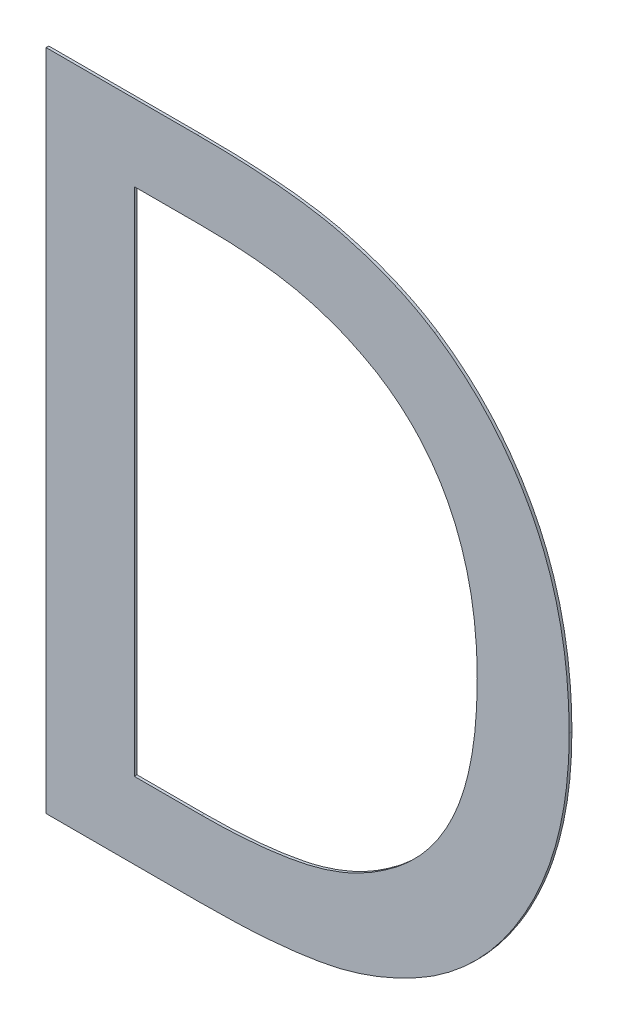
ISO-10303-21;
HEADER;
FILE_DESCRIPTION(('STEP AP214'),'2;1');
FILE_NAME('part.step','',(''),(''),'','','');
FILE_SCHEMA(('AUTOMOTIVE_DESIGN { 1 0 10303 214 1 1 1 1 }'));
ENDSEC;
DATA;
#1=APPLICATION_CONTEXT('core data for automotive mechanical design processes');
#2=APPLICATION_PROTOCOL_DEFINITION('international standard','automotive_design',2000,#1);
#3=PRODUCT_CONTEXT('',#1,'mechanical');
#4=PRODUCT('Part','Part','',(#3));
#5=PRODUCT_RELATED_PRODUCT_CATEGORY('part','',(#4));
#6=PRODUCT_DEFINITION_FORMATION('','',#4);
#7=PRODUCT_DEFINITION_CONTEXT('part definition',#1,'design');
#8=PRODUCT_DEFINITION('design','',#6,#7);
#9=PRODUCT_DEFINITION_SHAPE('','',#8);
#10=(LENGTH_UNIT() NAMED_UNIT(*) SI_UNIT(.MILLI.,.METRE.));
#11=(NAMED_UNIT(*) PLANE_ANGLE_UNIT() SI_UNIT($,.RADIAN.));
#12=(NAMED_UNIT(*) SI_UNIT($,.STERADIAN.) SOLID_ANGLE_UNIT());
#13=UNCERTAINTY_MEASURE_WITH_UNIT(LENGTH_MEASURE(1.E-05),#10,'distance_accuracy_value','');
#14=(GEOMETRIC_REPRESENTATION_CONTEXT(3) GLOBAL_UNCERTAINTY_ASSIGNED_CONTEXT((#13)) GLOBAL_UNIT_ASSIGNED_CONTEXT((#10,
#11,#12)) REPRESENTATION_CONTEXT('',''));
#15=CARTESIAN_POINT('',(0.,0.,0.));
#16=DIRECTION('',(0.,0.,1.));
#17=DIRECTION('',(1.,0.,0.));
#18=AXIS2_PLACEMENT_3D('',#15,#16,#17);
#19=CARTESIAN_POINT('',(-0.375230190296568,-1.23808482725956,0.));
#20=CARTESIAN_POINT('',(-0.375230190296568,-1.23808482725956,0.002));
#21=CARTESIAN_POINT('',(-0.34108108259972,-1.21505403369657,0.));
#22=CARTESIAN_POINT('',(-0.34108108259972,-1.21505403369657,0.002));
#23=CARTESIAN_POINT('',(-0.306931974902872,-1.13881416535012,0.));
#24=CARTESIAN_POINT('',(-0.306931974902872,-1.13881416535012,0.002));
#25=CARTESIAN_POINT('',(-0.306931974902872,-1.08163426409028,0.));
#26=CARTESIAN_POINT('',(-0.306931974902872,-1.08163426409028,0.002));
#27=B_SPLINE_SURFACE_WITH_KNOTS('',2,1,((#19,#20),(#21,#22),(#23,#24),(#25,#26)),.UNSPECIFIED.,
.F.,.F.,.F.,(3,1,3),(2,2),(0.,0.5,1.),(0.,1.),.UNSPECIFIED.);
#28=CARTESIAN_POINT('',(-0.375230190296568,-1.23808482725956,0.));
#29=CARTESIAN_POINT('',(-0.369071120010196,-1.2339546476136,0.));
#30=CARTESIAN_POINT('',(-0.363227315626951,-1.22934472335801,0.));
#31=CARTESIAN_POINT('',(-0.352341112252358,-1.21929144189648,0.));
#32=CARTESIAN_POINT('',(-0.347296320695378,-1.21385067251658,0.));
#33=CARTESIAN_POINT('',(-0.338234080051032,-1.20235511353973,0.));
#34=CARTESIAN_POINT('',(-0.334197566741436,-1.1963153243592,0.));
#35=CARTESIAN_POINT('',(-0.327044623987746,-1.18372060379909,0.));
#36=CARTESIAN_POINT('',(-0.323927870723671,-1.17716585475306,0.));
#37=CARTESIAN_POINT('',(-0.318400111465898,-1.16314582994729,0.));
#38=CARTESIAN_POINT('',(-0.316067864817408,-1.15564995582732,0.));
#39=CARTESIAN_POINT('',(-0.312285435497127,-1.14042791323623,0.));
#40=CARTESIAN_POINT('',(-0.310837633188868,-1.13270118148244,0.));
#41=CARTESIAN_POINT('',(-0.308738205524137,-1.11773485181182,0.));
#42=CARTESIAN_POINT('',(-0.308035135644672,-1.11050203727301,0.));
#43=CARTESIAN_POINT('',(-0.307135909254335,-1.09605493101003,0.));
#44=CARTESIAN_POINT('',(-0.306936213018837,-1.08884086834512,0.));
#45=CARTESIAN_POINT('',(-0.306931974902872,-1.08163426409028,0.));
#46=B_SPLINE_CURVE_WITH_KNOTS('',3,(#28,#29,#30,#31,#32,#33,#34,#35,#36,#37,#38,#39,#40,#41,#42,
#43,#44,#45),.UNSPECIFIED.,.F.,.F.,(4,2,2,2,2,2,2,2,4),(0.,0.0222348262861986,
0.0444017596600262,0.0661109238585652,0.0878124357665264,0.111292241318025,0.13483496437413,
0.156617057358406,0.178245545840537),.UNSPECIFIED.);
#47=CARTESIAN_POINT('',(-0.375230190296568,-1.23808482725956,0.));
#48=VERTEX_POINT('',#47);
#49=CARTESIAN_POINT('',(-0.306931974902872,-1.08163426409028,0.));
#50=VERTEX_POINT('',#49);
#51=EDGE_CURVE('E11',#48,#50,#46,.T.);
#52=DIRECTION('',(0.,0.,1.));
#53=VECTOR('',#52,1.);
#54=CARTESIAN_POINT('',(-0.375230190296568,-1.23808482725956,0.));
#55=LINE('',#54,#53);
#56=CARTESIAN_POINT('',(-0.375230190296568,-1.23808482725956,0.002));
#57=VERTEX_POINT('',#56);
#58=EDGE_CURVE('E254',#48,#57,#55,.T.);
#59=CARTESIAN_POINT('',(-0.306931974902872,-1.08163426409028,0.002));
#60=CARTESIAN_POINT('',(-0.306960944569356,-1.09311216923514,0.002));
#61=CARTESIAN_POINT('',(-0.307453841034369,-1.10466919796026,0.002));
#62=CARTESIAN_POINT('',(-0.309894937130853,-1.12777485772944,0.002));
#63=CARTESIAN_POINT('',(-0.311862661657671,-1.13932127621205,0.002));
#64=CARTESIAN_POINT('',(-0.31681199549396,-1.15812700217671,0.002));
#65=CARTESIAN_POINT('',(-0.31923288315732,-1.16552633653169,0.002));
#66=CARTESIAN_POINT('',(-0.325134557052641,-1.17985830346347,0.002));
#67=CARTESIAN_POINT('',(-0.328610378836024,-1.18679294017165,0.002));
#68=CARTESIAN_POINT('',(-0.33619291554513,-1.19934955880884,0.002));
#69=CARTESIAN_POINT('',(-0.340197643101653,-1.2050331633398,0.002));
#70=CARTESIAN_POINT('',(-0.349018886974442,-1.21574502638608,0.002));
#71=CARTESIAN_POINT('',(-0.353836050360118,-1.22077275682089,0.002));
#72=CARTESIAN_POINT('',(-0.36154597026652,-1.22772030855257,0.002));
#73=CARTESIAN_POINT('',(-0.364184675443781,-1.22992918087731,0.002));
#74=CARTESIAN_POINT('',(-0.369604145539521,-1.23415184819776,0.002));
#75=CARTESIAN_POINT('',(-0.372384568112839,-1.23616608216329,0.002));
#76=CARTESIAN_POINT('',(-0.375230190549302,-1.23808482743001,0.002));
#77=B_SPLINE_CURVE_WITH_KNOTS('',3,(#59,#60,#61,#62,#63,#64,#65,#66,#67,#68,#69,#70,#71,#72,#73,
#74,#75,#76),.UNSPECIFIED.,.F.,.F.,(4,2,2,2,2,2,2,2,4),(0.,0.034553978737306,0.0695736725759889,
0.0928581301950071,0.116034668435323,0.136821780288929,0.157625527030922,0.167941944336336,
0.178234523577318),.UNSPECIFIED.);
#78=CARTESIAN_POINT('',(-0.306931974902872,-1.08163426409028,0.002));
#79=VERTEX_POINT('',#78);
#80=EDGE_CURVE('E261',#79,#57,#77,.T.);
#81=DIRECTION('',(0.,0.,1.));
#82=VECTOR('',#81,1.);
#83=CARTESIAN_POINT('',(-0.306931974902872,-1.08163426409028,0.));
#84=LINE('',#83,#82);
#85=EDGE_CURVE('E280',#50,#79,#84,.T.);
#86=ORIENTED_EDGE('',*,*,#51,.F.);
#87=ORIENTED_EDGE('',*,*,#58,.T.);
#88=ORIENTED_EDGE('',*,*,#80,.F.);
#89=ORIENTED_EDGE('',*,*,#85,.F.);
#90=EDGE_LOOP('',(#86,#87,#88,#89));
#91=FACE_BOUND('',#90,.T.);
#92=ADVANCED_FACE('F17',(#91),#27,.F.);
#93=CARTESIAN_POINT('',(-0.510635373141046,-1.27064560436586,0.));
#94=CARTESIAN_POINT('',(-0.510635373141046,-1.27064560436586,0.002));
#95=CARTESIAN_POINT('',(-0.467353364548529,-1.27064560436586,0.));
#96=CARTESIAN_POINT('',(-0.467353364548529,-1.27064560436586,0.002));
#97=CARTESIAN_POINT('',(-0.401834727688298,-1.25674771169853,0.));
#98=CARTESIAN_POINT('',(-0.401834727688298,-1.25674771169853,0.002));
#99=CARTESIAN_POINT('',(-0.375230190296568,-1.23808482725956,0.));
#100=CARTESIAN_POINT('',(-0.375230190296568,-1.23808482725956,0.002));
#101=B_SPLINE_SURFACE_WITH_KNOTS('',2,1,((#93,#94),(#95,#96),(#97,#98),(#99,#100)),
.UNSPECIFIED.,.F.,.F.,.F.,(3,1,3),(2,2),(0.,0.5,1.),(0.,1.),.UNSPECIFIED.);
#102=CARTESIAN_POINT('',(-0.510635373141046,-1.27064560436586,0.));
#103=CARTESIAN_POINT('',(-0.504332889747488,-1.27064185696297,0.));
#104=CARTESIAN_POINT('',(-0.498027767844703,-1.27053399773559,0.));
#105=CARTESIAN_POINT('',(-0.485410139154331,-1.27005575539617,0.));
#106=CARTESIAN_POINT('',(-0.479097661306761,-1.26968463632515,0.));
#107=CARTESIAN_POINT('',(-0.466382061904667,-1.2686151741624,0.));
#108=CARTESIAN_POINT('',(-0.459979427612031,-1.26791089628076,0.));
#109=CARTESIAN_POINT('',(-0.447229597578087,-1.26613078942527,0.));
#110=CARTESIAN_POINT('',(-0.440882352227835,-1.26505533772997,0.));
#111=CARTESIAN_POINT('',(-0.430492329115305,-1.26281042261025,0.));
#112=CARTESIAN_POINT('',(-0.426415688707686,-1.2618036835315,0.));
#113=CARTESIAN_POINT('',(-0.418355337899598,-1.25947303527224,0.));
#114=CARTESIAN_POINT('',(-0.414371612361413,-1.25814917815841,0.));
#115=CARTESIAN_POINT('',(-0.402649026936383,-1.25373667010387,0.));
#116=CARTESIAN_POINT('',(-0.395072142135779,-1.25019324547952,0.));
#117=CARTESIAN_POINT('',(-0.385676402555752,-1.2448447458593,0.));
#118=CARTESIAN_POINT('',(-0.383546241988096,-1.24356351463242,0.));
#119=CARTESIAN_POINT('',(-0.379343286697743,-1.24089915146737,0.));
#120=CARTESIAN_POINT('',(-0.377270645313756,-1.23951577755444,0.));
#121=CARTESIAN_POINT('',(-0.375230190103475,-1.23808482712411,0.));
#122=B_SPLINE_CURVE_WITH_KNOTS('',3,(#102,#103,#104,#105,#106,#107,#108,#109,#110,#111,#112,
#113,#114,#115,#116,#117,#118,#119,#120,#121),.UNSPECIFIED.,.F.,.F.,(4,2,2,2,2,2,2,2,2,4),(0.,
0.0189108252165691,0.0378747262079458,0.0571899530628519,0.0764856045518722,0.0890717128648824,
0.101655756116182,0.126621762006657,0.134077444981571,0.141551395050654),.UNSPECIFIED.);
#123=CARTESIAN_POINT('',(-0.510635373141046,-1.27064560436586,0.));
#124=VERTEX_POINT('',#123);
#125=EDGE_CURVE('E32',#124,#48,#122,.T.);
#126=DIRECTION('',(0.,0.,1.));
#127=VECTOR('',#126,1.);
#128=CARTESIAN_POINT('',(-0.510635373141046,-1.27064560436586,0.));
#129=LINE('',#128,#127);
#130=CARTESIAN_POINT('',(-0.510635373141046,-1.27064560436586,0.002));
#131=VERTEX_POINT('',#130);
#132=EDGE_CURVE('E259',#124,#131,#129,.T.);
#133=CARTESIAN_POINT('',(-0.375230190296568,-1.23808482725956,0.002));
#134=CARTESIAN_POINT('',(-0.381865661201128,-1.24276171666051,0.002));
#135=CARTESIAN_POINT('',(-0.388874410773785,-1.24690509466637,0.002));
#136=CARTESIAN_POINT('',(-0.403335314191685,-1.25401944225042,0.002));
#137=CARTESIAN_POINT('',(-0.410779349169612,-1.25700689022562,0.002));
#138=CARTESIAN_POINT('',(-0.422773941941858,-1.26081595974773,0.002));
#139=CARTESIAN_POINT('',(-0.427207692247071,-1.26201823622905,0.002));
#140=CARTESIAN_POINT('',(-0.436154103349204,-1.2640872904202,0.002));
#141=CARTESIAN_POINT('',(-0.440666818706485,-1.26495382574649,0.002));
#142=CARTESIAN_POINT('',(-0.454308965494795,-1.26725223974172,0.002));
#143=CARTESIAN_POINT('',(-0.46349088749112,-1.26836932687121,0.002));
#144=CARTESIAN_POINT('',(-0.479034571388527,-1.26968120461285,0.002));
#145=CARTESIAN_POINT('',(-0.485383031765853,-1.27005496242888,0.002));
#146=CARTESIAN_POINT('',(-0.498033320415536,-1.27053397975994,0.002));
#147=CARTESIAN_POINT('',(-0.504335055055847,-1.27064162198114,0.002));
#148=CARTESIAN_POINT('',(-0.510635373141048,-1.27064560436586,0.002));
#149=B_SPLINE_CURVE_WITH_KNOTS('',3,(#133,#134,#135,#136,#137,#138,#139,#140,#141,#142,#143,
#144,#145,#146,#147,#148),.UNSPECIFIED.,.F.,.F.,(4,2,2,2,2,2,2,4),(0.,0.0243283791826347,
0.0482959029329772,0.0620635905577237,0.075841199130685,0.103555509462391,0.122628803408617,
0.141530693026012),.UNSPECIFIED.);
#150=EDGE_CURVE('E273',#57,#131,#149,.T.);
#151=ORIENTED_EDGE('',*,*,#125,.F.);
#152=ORIENTED_EDGE('',*,*,#132,.T.);
#153=ORIENTED_EDGE('',*,*,#150,.F.);
#154=ORIENTED_EDGE('',*,*,#58,.F.);
#155=EDGE_LOOP('',(#151,#152,#153,#154));
#156=FACE_BOUND('',#155,.T.);
#157=ADVANCED_FACE('F196',(#156),#101,.F.);
#158=CARTESIAN_POINT('',(-0.560270704095766,-1.27064560436586,0.));
#159=DIRECTION('',(0.,-1.,0.));
#160=DIRECTION('',(1.,0.,0.));
#161=AXIS2_PLACEMENT_3D('',#158,#159,#160);
#162=PLANE('',#161);
#163=DIRECTION('',(1.,0.,0.));
#164=VECTOR('',#163,1.);
#165=CARTESIAN_POINT('',(-0.560270704095766,-1.27064560436586,0.));
#166=LINE('',#165,#164);
#167=CARTESIAN_POINT('',(-0.560270704095766,-1.27064560436586,0.));
#168=VERTEX_POINT('',#167);
#169=EDGE_CURVE('E256',#168,#124,#166,.T.);
#170=ORIENTED_EDGE('',*,*,#169,.F.);
#171=DIRECTION('',(0.,0.,1.));
#172=VECTOR('',#171,1.);
#173=CARTESIAN_POINT('',(-0.560270704095766,-1.27064560436586,0.));
#174=LINE('',#173,#172);
#175=CARTESIAN_POINT('',(-0.560270704095766,-1.27064560436586,0.002));
#176=VERTEX_POINT('',#175);
#177=EDGE_CURVE('E271',#168,#176,#174,.T.);
#178=ORIENTED_EDGE('',*,*,#177,.T.);
#179=DIRECTION('',(-1.,0.,0.));
#180=VECTOR('',#179,1.);
#181=CARTESIAN_POINT('',(-0.510635373141046,-1.27064560436586,0.002));
#182=LINE('',#181,#180);
#183=EDGE_CURVE('E287',#131,#176,#182,.T.);
#184=ORIENTED_EDGE('',*,*,#183,.F.);
#185=ORIENTED_EDGE('',*,*,#132,.F.);
#186=EDGE_LOOP('',(#170,#178,#184,#185));
#187=FACE_BOUND('',#186,.T.);
#188=ADVANCED_FACE('F195',(#187),#162,.F.);
#189=CARTESIAN_POINT('',(-0.560270704095766,-0.893417089109979,0.));
#190=DIRECTION('',(-1.,0.,0.));
#191=DIRECTION('',(0.,-1.,0.));
#192=AXIS2_PLACEMENT_3D('',#189,#190,#191);
#193=PLANE('',#192);
#194=DIRECTION('',(0.,-1.,0.));
#195=VECTOR('',#194,1.);
#196=CARTESIAN_POINT('',(-0.560270704095766,-0.893417089109979,0.));
#197=LINE('',#196,#195);
#198=CARTESIAN_POINT('',(-0.560270704095766,-0.893417089109979,0.));
#199=VERTEX_POINT('',#198);
#200=EDGE_CURVE('E268',#199,#168,#197,.T.);
#201=ORIENTED_EDGE('',*,*,#200,.F.);
#202=DIRECTION('',(0.,0.,1.));
#203=VECTOR('',#202,1.);
#204=CARTESIAN_POINT('',(-0.560270704095766,-0.893417089109979,0.));
#205=LINE('',#204,#203);
#206=CARTESIAN_POINT('',(-0.560270704095766,-0.893417089109979,0.002));
#207=VERTEX_POINT('',#206);
#208=EDGE_CURVE('E286',#199,#207,#205,.T.);
#209=ORIENTED_EDGE('',*,*,#208,.T.);
#210=DIRECTION('',(0.,1.,0.));
#211=VECTOR('',#210,1.);
#212=CARTESIAN_POINT('',(-0.560270704095766,-1.27064560436586,0.002));
#213=LINE('',#212,#211);
#214=EDGE_CURVE('E295',#176,#207,#213,.T.);
#215=ORIENTED_EDGE('',*,*,#214,.F.);
#216=ORIENTED_EDGE('',*,*,#177,.F.);
#217=EDGE_LOOP('',(#201,#209,#215,#216));
#218=FACE_BOUND('',#217,.T.);
#219=ADVANCED_FACE('F401',(#218),#193,.F.);
#220=CARTESIAN_POINT('',(-0.510635373141046,-0.893417089109979,0.));
#221=DIRECTION('',(0.,1.,0.));
#222=DIRECTION('',(-1.,0.,0.));
#223=AXIS2_PLACEMENT_3D('',#220,#221,#222);
#224=PLANE('',#223);
#225=DIRECTION('',(-1.,0.,0.));
#226=VECTOR('',#225,1.);
#227=CARTESIAN_POINT('',(-0.510635373141046,-0.893417089109979,0.));
#228=LINE('',#227,#226);
#229=CARTESIAN_POINT('',(-0.510635373141046,-0.893417089109979,0.));
#230=VERTEX_POINT('',#229);
#231=EDGE_CURVE('E283',#230,#199,#228,.T.);
#232=ORIENTED_EDGE('',*,*,#231,.F.);
#233=DIRECTION('',(0.,0.,1.));
#234=VECTOR('',#233,1.);
#235=CARTESIAN_POINT('',(-0.510635373141046,-0.893417089109979,0.));
#236=LINE('',#235,#234);
#237=CARTESIAN_POINT('',(-0.510635373141046,-0.893417089109979,0.002));
#238=VERTEX_POINT('',#237);
#239=EDGE_CURVE('E292',#230,#238,#236,.T.);
#240=ORIENTED_EDGE('',*,*,#239,.T.);
#241=DIRECTION('',(1.,0.,0.));
#242=VECTOR('',#241,1.);
#243=CARTESIAN_POINT('',(-0.560270704095766,-0.893417089109979,0.002));
#244=LINE('',#243,#242);
#245=EDGE_CURVE('E304',#207,#238,#244,.T.);
#246=ORIENTED_EDGE('',*,*,#245,.F.);
#247=ORIENTED_EDGE('',*,*,#208,.F.);
#248=EDGE_LOOP('',(#232,#240,#246,#247));
#249=FACE_BOUND('',#248,.T.);
#250=ADVANCED_FACE('F321',(#249),#224,.F.);
#251=CARTESIAN_POINT('',(-0.381186430011134,-0.922801205035174,0.));
#252=CARTESIAN_POINT('',(-0.381186430011134,-0.922801205035174,0.002));
#253=CARTESIAN_POINT('',(-0.407393884755227,-0.907314981777301,0.));
#254=CARTESIAN_POINT('',(-0.407393884755227,-0.907314981777301,0.002));
#255=CARTESIAN_POINT('',(-0.466559199253254,-0.893417089109979,0.));
#256=CARTESIAN_POINT('',(-0.466559199253254,-0.893417089109979,0.002));
#257=CARTESIAN_POINT('',(-0.510635373141046,-0.893417089109979,0.));
#258=CARTESIAN_POINT('',(-0.510635373141046,-0.893417089109979,0.002));
#259=B_SPLINE_SURFACE_WITH_KNOTS('',2,1,((#251,#252),(#253,#254),(#255,#256),(#257,#258)),
.UNSPECIFIED.,.F.,.F.,.F.,(3,1,3),(2,2),(0.,0.5,1.),(0.,1.),.UNSPECIFIED.);
#260=CARTESIAN_POINT('',(-0.381186430011134,-0.922801205035174,0.));
#261=CARTESIAN_POINT('',(-0.389890920018549,-0.917644876008698,0.));
#262=CARTESIAN_POINT('',(-0.3990004450664,-0.913155427370382,0.));
#263=CARTESIAN_POINT('',(-0.417680681072181,-0.905660491708626,0.));
#264=CARTESIAN_POINT('',(-0.427244377928747,-0.902637504720381,0.));
#265=CARTESIAN_POINT('',(-0.443369300842974,-0.89887397723509,0.));
#266=CARTESIAN_POINT('',(-0.449834749436695,-0.89770618174463,0.));
#267=CARTESIAN_POINT('',(-0.462845792516856,-0.895849528662547,0.));
#268=CARTESIAN_POINT('',(-0.469391551045534,-0.895161917642023,0.));
#269=CARTESIAN_POINT('',(-0.487492312651944,-0.893775834766382,0.));
#270=CARTESIAN_POINT('',(-0.499081238494257,-0.893464653385604,0.));
#271=CARTESIAN_POINT('',(-0.510635373141052,-0.893417089109979,0.));
#272=B_SPLINE_CURVE_WITH_KNOTS('',3,(#260,#261,#262,#263,#264,#265,#266,#267,#268,#269,#270,
#271),.UNSPECIFIED.,.F.,.F.,(4,2,2,2,2,4),(0.,0.0303393041129854,0.0603070592219801,
0.0799919545714532,0.099727764322047,0.134431856877424),.UNSPECIFIED.);
#273=CARTESIAN_POINT('',(-0.381186430011134,-0.922801205035174,0.));
#274=VERTEX_POINT('',#273);
#275=EDGE_CURVE('E241',#274,#230,#272,.T.);
#276=CARTESIAN_POINT('',(-0.381186428646339,-0.922801205871661,0.));
#277=CARTESIAN_POINT('',(-0.381186429328737,-0.922801205453417,0.00033333333333312));
#278=CARTESIAN_POINT('',(-0.381186429783668,-0.922801205174589,0.000666666666666453));
#279=CARTESIAN_POINT('',(-0.3811864302386,-0.92280120489576,0.00133333333333312));
#280=CARTESIAN_POINT('',(-0.3811864302386,-0.92280120489576,0.00166666666666645));
#281=CARTESIAN_POINT('',(-0.381186430011134,-0.922801205035174,0.002));
#282=B_SPLINE_CURVE_WITH_KNOTS('',3,(#276,#277,#278,#279,#280,#281),.UNSPECIFIED.,.F.,.F.,(4,2,
4),(0.,0.00100000000000128,0.00200000000000128),.UNSPECIFIED.);
#283=CARTESIAN_POINT('',(-0.381186430011134,-0.922801205035174,0.002));
#284=VERTEX_POINT('',#283);
#285=EDGE_CURVE('E302',#274,#284,#282,.T.);
#286=CARTESIAN_POINT('',(-0.510635373141046,-0.893417089109979,0.002));
#287=CARTESIAN_POINT('',(-0.505354139153652,-0.893419411240316,0.002));
#288=CARTESIAN_POINT('',(-0.500071443624809,-0.89349231853913,0.002));
#289=CARTESIAN_POINT('',(-0.489501477511182,-0.893819800219284,0.002));
#290=CARTESIAN_POINT('',(-0.484214218484674,-0.894074732977307,0.002));
#291=CARTESIAN_POINT('',(-0.473629603001648,-0.894808791016752,0.002));
#292=CARTESIAN_POINT('',(-0.468332315713613,-0.89528896342371,0.002));
#293=CARTESIAN_POINT('',(-0.457773205635299,-0.896527007588404,0.002));
#294=CARTESIAN_POINT('',(-0.452511357402656,-0.897284652106301,0.002));
#295=CARTESIAN_POINT('',(-0.441098733818833,-0.899359043537907,0.002));
#296=CARTESIAN_POINT('',(-0.434961344503911,-0.900752691439672,0.002));
#297=CARTESIAN_POINT('',(-0.422863329929407,-0.904120100185101,0.002));
#298=CARTESIAN_POINT('',(-0.416902312210009,-0.906092446463908,0.002));
#299=CARTESIAN_POINT('',(-0.405890582696059,-0.91032777349166,0.002));
#300=CARTESIAN_POINT('',(-0.400815781416196,-0.912528503874206,0.002));
#301=CARTESIAN_POINT('',(-0.390849815809634,-0.917352577093648,0.002));
#302=CARTESIAN_POINT('',(-0.385959334605152,-0.919977331544125,0.002));
#303=CARTESIAN_POINT('',(-0.381186430009602,-0.922801205036079,0.002));
#304=B_SPLINE_CURVE_WITH_KNOTS('',3,(#286,#287,#288,#289,#290,#291,#292,#293,#294,#295,#296,
#297,#298,#299,#300,#301,#302,#303),.UNSPECIFIED.,.F.,.F.,(4,2,2,2,2,2,2,2,4),(0.,
0.0158455003671106,0.0317222841163259,0.0476736208991376,0.0636119232082097,0.0824645607433684,
0.10127149362815,0.117846977835548,0.134478825670011),.UNSPECIFIED.);
#305=EDGE_CURVE('E333',#238,#284,#304,.T.);
#306=ORIENTED_EDGE('',*,*,#275,.F.);
#307=ORIENTED_EDGE('',*,*,#285,.T.);
#308=ORIENTED_EDGE('',*,*,#305,.F.);
#309=ORIENTED_EDGE('',*,*,#239,.F.);
#310=EDGE_LOOP('',(#306,#307,#308,#309));
#311=FACE_BOUND('',#310,.T.);
#312=ADVANCED_FACE('F316',(#311),#259,.F.);
#313=CARTESIAN_POINT('',(-0.306931974902872,-1.08163426409028,0.));
#314=CARTESIAN_POINT('',(-0.306931974902872,-1.08163426409028,0.002));
#315=CARTESIAN_POINT('',(-0.306931974902872,-1.02524852812572,0.));
#316=CARTESIAN_POINT('',(-0.306931974902872,-1.02524852812572,0.002));
#317=CARTESIAN_POINT('',(-0.344257743780822,-0.945434915950526,0.));
#318=CARTESIAN_POINT('',(-0.344257743780822,-0.945434915950526,0.002));
#319=CARTESIAN_POINT('',(-0.381186430011134,-0.922801205035174,0.));
#320=CARTESIAN_POINT('',(-0.381186430011134,-0.922801205035174,0.002));
#321=B_SPLINE_SURFACE_WITH_KNOTS('',2,1,((#313,#314),(#315,#316),(#317,#318),(#319,#320)),
.UNSPECIFIED.,.F.,.F.,.F.,(3,1,3),(2,2),(0.,0.5,1.),(0.,1.),.UNSPECIFIED.);
#322=CARTESIAN_POINT('',(-0.306931974902872,-1.08163426409028,0.));
#323=CARTESIAN_POINT('',(-0.306960520756939,-1.06995091538817,0.));
#324=CARTESIAN_POINT('',(-0.307541616686638,-1.05822666292724,0.));
#325=CARTESIAN_POINT('',(-0.310312224949972,-1.03482302341863,0.));
#326=CARTESIAN_POINT('',(-0.312523102014064,-1.02314632393673,0.));
#327=CARTESIAN_POINT('',(-0.320349854499977,-0.995874781314095,0.));
#328=CARTESIAN_POINT('',(-0.326951514202023,-0.980509922122755,0.));
#329=CARTESIAN_POINT('',(-0.33985637635909,-0.960631383511358,0.));
#330=CARTESIAN_POINT('',(-0.34425789630766,-0.954858153788338,0.));
#331=CARTESIAN_POINT('',(-0.353914362822835,-0.944060546536554,0.));
#332=CARTESIAN_POINT('',(-0.359169752636304,-0.939036560554662,0.));
#333=CARTESIAN_POINT('',(-0.367372322475874,-0.932317489615533,0.));
#334=CARTESIAN_POINT('',(-0.370047699652896,-0.930280959698914,0.));
#335=CARTESIAN_POINT('',(-0.375525115138918,-0.926399332442209,0.));
#336=CARTESIAN_POINT('',(-0.378326859268839,-0.924553820414005,0.));
#337=CARTESIAN_POINT('',(-0.381186430230407,-0.922801204900781,0.));
#338=B_SPLINE_CURVE_WITH_KNOTS('',3,(#322,#323,#324,#325,#326,#327,#328,#329,#330,#331,#332,
#333,#334,#335,#336,#337),.UNSPECIFIED.,.F.,.F.,(4,2,2,2,2,2,2,4),(0.,0.0350880797401535,
0.0706444958203738,0.119943848394217,0.141645722982823,0.16335889929713,0.173439359759497,
0.183497455713212),.UNSPECIFIED.);
#339=EDGE_CURVE('E232',#50,#274,#338,.T.);
#340=CARTESIAN_POINT('',(-0.381186430011134,-0.922801205035174,0.002));
#341=CARTESIAN_POINT('',(-0.374840458660437,-0.926667214915892,0.002));
#342=CARTESIAN_POINT('',(-0.368788438829146,-0.931026500174776,0.002));
#343=CARTESIAN_POINT('',(-0.357456718794459,-0.940611744670721,0.002));
#344=CARTESIAN_POINT('',(-0.352174083102761,-0.945834238325026,0.002));
#345=CARTESIAN_POINT('',(-0.342601116335016,-0.956955860307139,0.002));
#346=CARTESIAN_POINT('',(-0.338294483560958,-0.962840953112284,0.002));
#347=CARTESIAN_POINT('',(-0.330598108275468,-0.975177037219769,0.002));
#348=CARTESIAN_POINT('',(-0.327208493484643,-0.981628107184855,0.002));
#349=CARTESIAN_POINT('',(-0.320866771261709,-0.995915579325259,0.002));
#350=CARTESIAN_POINT('',(-0.318056722022446,-1.00381456950886,0.002));
#351=CARTESIAN_POINT('',(-0.313465999867241,-1.01991293444137,0.002));
#352=CARTESIAN_POINT('',(-0.311687998734642,-1.02811303092896,0.002));
#353=CARTESIAN_POINT('',(-0.307933973706135,-1.05133903683909,0.002));
#354=CARTESIAN_POINT('',(-0.306952330699312,-1.06654202782406,0.002));
#355=CARTESIAN_POINT('',(-0.306931974902872,-1.08163426409028,0.002));
#356=B_SPLINE_CURVE_WITH_KNOTS('',3,(#340,#341,#342,#343,#344,#345,#346,#347,#348,#349,#350,
#351,#352,#353,#354,#355),.UNSPECIFIED.,.F.,.F.,(4,2,2,2,2,2,2,4),(0.,0.0222804032831938,
0.0444734368597093,0.066262790945159,0.0880551782519531,0.113118906662009,0.138247234365915,
0.183618949031491),.UNSPECIFIED.);
#357=EDGE_CURVE('E345',#284,#79,#356,.T.);
#358=ORIENTED_EDGE('',*,*,#339,.F.);
#359=ORIENTED_EDGE('',*,*,#85,.T.);
#360=ORIENTED_EDGE('',*,*,#357,.F.);
#361=ORIENTED_EDGE('',*,*,#285,.F.);
#362=EDGE_LOOP('',(#358,#359,#360,#361));
#363=FACE_BOUND('',#362,.T.);
#364=ADVANCED_FACE('F312',(#363),#321,.F.);
#365=CARTESIAN_POINT('',(-0.512620786379234,-1.32703134033042,0.));
#366=CARTESIAN_POINT('',(-0.512620786379234,-1.32703134033042,0.002));
#367=CARTESIAN_POINT('',(-0.45305838923357,-1.32703134033042,0.));
#368=CARTESIAN_POINT('',(-0.45305838923357,-1.32703134033042,0.002));
#369=CARTESIAN_POINT('',(-0.376421438239481,-1.31114803442491,0.));
#370=CARTESIAN_POINT('',(-0.376421438239481,-1.31114803442491,0.002));
#371=CARTESIAN_POINT('',(-0.339095669361531,-1.28772015821428,0.));
#372=CARTESIAN_POINT('',(-0.339095669361531,-1.28772015821428,0.002));
#373=B_SPLINE_SURFACE_WITH_KNOTS('',2,1,((#365,#366),(#367,#368),(#369,#370),(#371,#372)),
.UNSPECIFIED.,.F.,.F.,.F.,(3,1,3),(2,2),(0.,0.5,1.),(0.,1.),.UNSPECIFIED.);
#374=CARTESIAN_POINT('',(-0.339095669361531,-1.28772015821428,0.));
#375=CARTESIAN_POINT('',(-0.349167800521507,-1.2940615747307,0.));
#376=CARTESIAN_POINT('',(-0.359707492508057,-1.29977597399759,0.));
#377=CARTESIAN_POINT('',(-0.381472227486952,-1.30952864782094,0.));
#378=CARTESIAN_POINT('',(-0.392694049014975,-1.31357419060561,0.));
#379=CARTESIAN_POINT('',(-0.407930381741691,-1.31759077105921,0.));
#380=CARTESIAN_POINT('',(-0.411709124486427,-1.31847098172178,0.));
#381=CARTESIAN_POINT('',(-0.416024634479058,-1.31935326628216,0.));
#382=CARTESIAN_POINT('',(-0.416541240535696,-1.31945689610551,0.));
#383=CARTESIAN_POINT('',(-0.41810710700794,-1.31976632123481,0.));
#384=CARTESIAN_POINT('',(-0.41915729090185,-1.31996748083855,0.));
#385=CARTESIAN_POINT('',(-0.422372468605824,-1.32056422306683,0.));
#386=CARTESIAN_POINT('',(-0.424541090328469,-1.32094027117462,0.));
#387=CARTESIAN_POINT('',(-0.431307690750376,-1.32204052068106,0.));
#388=CARTESIAN_POINT('',(-0.435918632117895,-1.32268546465618,0.));
#389=CARTESIAN_POINT('',(-0.450806746753343,-1.32450561981912,0.));
#390=CARTESIAN_POINT('',(-0.461120692799805,-1.32536537505466,0.));
#391=CARTESIAN_POINT('',(-0.485165053271923,-1.32671220617568,0.));
#392=CARTESIAN_POINT('',(-0.49890937331802,-1.32698536532656,0.));
#393=CARTESIAN_POINT('',(-0.51262078637925,-1.32703134033042,0.));
#394=B_SPLINE_CURVE_WITH_KNOTS('',3,(#374,#375,#376,#377,#378,#379,#380,#381,#382,#383,#384,
#385,#386,#387,#388,#389,#390,#391,#392,#393),.UNSPECIFIED.,.F.,.F.,(4,2,2,2,2,2,2,2,2,4),(0.,
0.035783501734342,0.0714094699986858,0.0830429323173391,0.0846236266892511,0.087831374386067,
0.0944337964295487,0.108397056483181,0.139428198000438,0.180610432751354),.UNSPECIFIED.);
#395=CARTESIAN_POINT('',(-0.339095669361531,-1.28772015821428,0.));
#396=VERTEX_POINT('',#395);
#397=CARTESIAN_POINT('',(-0.512620786379234,-1.32703134033042,0.));
#398=VERTEX_POINT('',#397);
#399=EDGE_CURVE('E222',#396,#398,#394,.T.);
#400=DIRECTION('',(0.,0.,1.));
#401=VECTOR('',#400,1.);
#402=CARTESIAN_POINT('',(-0.339095669361531,-1.28772015821428,0.));
#403=LINE('',#402,#401);
#404=CARTESIAN_POINT('',(-0.339095669361531,-1.28772015821428,0.002));
#405=VERTEX_POINT('',#404);
#406=EDGE_CURVE('E343',#396,#405,#403,.T.);
#407=CARTESIAN_POINT('',(-0.512620786379234,-1.32703134033042,0.002));
#408=CARTESIAN_POINT('',(-0.505823366873342,-1.32703049416569,0.002));
#409=CARTESIAN_POINT('',(-0.49902715198429,-1.3269542686434,0.002));
#410=CARTESIAN_POINT('',(-0.485431317744928,-1.32661221274315,0.002));
#411=CARTESIAN_POINT('',(-0.478631704477683,-1.32634614942937,0.002));
#412=CARTESIAN_POINT('',(-0.458209401815631,-1.32520305715211,0.002));
#413=CARTESIAN_POINT('',(-0.444598045645811,-1.32398073001722,0.002));
#414=CARTESIAN_POINT('',(-0.425362111771471,-1.32112371652292,0.002));
#415=CARTESIAN_POINT('',(-0.41964583408199,-1.32013037367575,0.002));
#416=CARTESIAN_POINT('',(-0.413462607187009,-1.31882109541325,0.002));
#417=CARTESIAN_POINT('',(-0.412951928737026,-1.3187111990007,0.002));
#418=CARTESIAN_POINT('',(-0.41141937772317,-1.31837494553869,0.002));
#419=CARTESIAN_POINT('',(-0.410398856772446,-1.31814240256307,0.002));
#420=CARTESIAN_POINT('',(-0.40733460779285,-1.31741916739348,0.002));
#421=CARTESIAN_POINT('',(-0.40529650682342,-1.3169045607617,0.002));
#422=CARTESIAN_POINT('',(-0.399167807627092,-1.31525656527204,0.002));
#423=CARTESIAN_POINT('',(-0.395102756836476,-1.31402713982884,0.002));
#424=CARTESIAN_POINT('',(-0.38282413307209,-1.3099102552664,0.002));
#425=CARTESIAN_POINT('',(-0.374739256573713,-1.30663791852979,0.002));
#426=CARTESIAN_POINT('',(-0.357291456620995,-1.29844965127042,0.002));
#427=CARTESIAN_POINT('',(-0.348021664594177,-1.29333226656392,0.002));
#428=CARTESIAN_POINT('',(-0.339095669345866,-1.28772015820445,0.002));
#429=B_SPLINE_CURVE_WITH_KNOTS('',3,(#407,#408,#409,#410,#411,#412,#413,#414,#415,#416,#417,
#418,#419,#420,#421,#422,#423,#424,#425,#426,#427,#428),.UNSPECIFIED.,.F.,.F.,(4,2,2,2,2,2,2,2,
2,2,4),(0.,0.0203888845463764,0.0408028298930075,0.0817350131970531,0.0991288260622823,
0.100695922550811,0.103835830487979,0.110141084984766,0.12287366640992,0.148983944037564,
0.180638220935633),.UNSPECIFIED.);
#430=CARTESIAN_POINT('',(-0.512620786379234,-1.32703134033042,0.002));
#431=VERTEX_POINT('',#430);
#432=EDGE_CURVE('E148',#431,#405,#429,.T.);
#433=DIRECTION('',(0.,0.,1.));
#434=VECTOR('',#433,1.);
#435=CARTESIAN_POINT('',(-0.512620786379234,-1.32703134033042,0.));
#436=LINE('',#435,#434);
#437=EDGE_CURVE('E355',#398,#431,#436,.T.);
#438=ORIENTED_EDGE('',*,*,#399,.F.);
#439=ORIENTED_EDGE('',*,*,#406,.T.);
#440=ORIENTED_EDGE('',*,*,#432,.F.);
#441=ORIENTED_EDGE('',*,*,#437,.F.);
#442=EDGE_LOOP('',(#438,#439,#440,#441));
#443=FACE_BOUND('',#442,.T.);
#444=ADVANCED_FACE('F322',(#443),#373,.T.);
#445=CARTESIAN_POINT('',(-0.62539225830836,-1.32703134033042,0.));
#446=DIRECTION('',(0.,-1.,0.));
#447=DIRECTION('',(1.,0.,0.));
#448=AXIS2_PLACEMENT_3D('',#445,#446,#447);
#449=PLANE('',#448);
#450=DIRECTION('',(-1.,0.,0.));
#451=VECTOR('',#450,1.);
#452=CARTESIAN_POINT('',(-0.512620786379234,-1.32703134033042,0.));
#453=LINE('',#452,#451);
#454=CARTESIAN_POINT('',(-0.62539225830836,-1.32703134033042,0.));
#455=VERTEX_POINT('',#454);
#456=EDGE_CURVE('E340',#398,#455,#453,.T.);
#457=ORIENTED_EDGE('',*,*,#456,.F.);
#458=ORIENTED_EDGE('',*,*,#437,.T.);
#459=DIRECTION('',(1.,0.,0.));
#460=VECTOR('',#459,1.);
#461=CARTESIAN_POINT('',(-0.62539225830836,-1.32703134033042,0.002));
#462=LINE('',#461,#460);
#463=CARTESIAN_POINT('',(-0.62539225830836,-1.32703134033042,0.002));
#464=VERTEX_POINT('',#463);
#465=EDGE_CURVE('E366',#464,#431,#462,.T.);
#466=ORIENTED_EDGE('',*,*,#465,.F.);
#467=DIRECTION('',(0.,0.,1.));
#468=VECTOR('',#467,1.);
#469=CARTESIAN_POINT('',(-0.62539225830836,-1.32703134033042,0.));
#470=LINE('',#469,#468);
#471=EDGE_CURVE('E365',#455,#464,#470,.T.);
#472=ORIENTED_EDGE('',*,*,#471,.F.);
#473=EDGE_LOOP('',(#457,#458,#466,#472));
#474=FACE_BOUND('',#473,.T.);
#475=ADVANCED_FACE('F384',(#474),#449,.T.);
#476=CARTESIAN_POINT('',(-0.62539225830836,-0.837031353145417,0.));
#477=DIRECTION('',(-1.,0.,0.));
#478=DIRECTION('',(0.,-1.,0.));
#479=AXIS2_PLACEMENT_3D('',#476,#477,#478);
#480=PLANE('',#479);
#481=DIRECTION('',(0.,1.,0.));
#482=VECTOR('',#481,1.);
#483=CARTESIAN_POINT('',(-0.62539225830836,-1.32703134033042,0.));
#484=LINE('',#483,#482);
#485=CARTESIAN_POINT('',(-0.62539225830836,-0.837031353145417,0.));
#486=VERTEX_POINT('',#485);
#487=EDGE_CURVE('E352',#455,#486,#484,.T.);
#488=ORIENTED_EDGE('',*,*,#487,.F.);
#489=ORIENTED_EDGE('',*,*,#471,.T.);
#490=DIRECTION('',(0.,-1.,0.));
#491=VECTOR('',#490,1.);
#492=CARTESIAN_POINT('',(-0.62539225830836,-0.837031353145417,0.002));
#493=LINE('',#492,#491);
#494=CARTESIAN_POINT('',(-0.62539225830836,-0.837031353145417,0.002));
#495=VERTEX_POINT('',#494);
#496=EDGE_CURVE('E371',#495,#464,#493,.T.);
#497=ORIENTED_EDGE('',*,*,#496,.F.);
#498=DIRECTION('',(0.,0.,1.));
#499=VECTOR('',#498,1.);
#500=CARTESIAN_POINT('',(-0.62539225830836,-0.837031353145417,0.));
#501=LINE('',#500,#499);
#502=EDGE_CURVE('E370',#486,#495,#501,.T.);
#503=ORIENTED_EDGE('',*,*,#502,.F.);
#504=EDGE_LOOP('',(#488,#489,#497,#503));
#505=FACE_BOUND('',#504,.T.);
#506=ADVANCED_FACE('F173',(#505),#480,.T.);
#507=CARTESIAN_POINT('',(-0.513812034322148,-0.837031353145417,0.));
#508=DIRECTION('',(0.,1.,0.));
#509=DIRECTION('',(-1.,0.,0.));
#510=AXIS2_PLACEMENT_3D('',#507,#508,#509);
#511=PLANE('',#510);
#512=DIRECTION('',(1.,0.,0.));
#513=VECTOR('',#512,1.);
#514=CARTESIAN_POINT('',(-0.62539225830836,-0.837031353145417,0.));
#515=LINE('',#514,#513);
#516=CARTESIAN_POINT('',(-0.513812034322148,-0.837031353145417,0.));
#517=VERTEX_POINT('',#516);
#518=EDGE_CURVE('E362',#486,#517,#515,.T.);
#519=ORIENTED_EDGE('',*,*,#518,.F.);
#520=ORIENTED_EDGE('',*,*,#502,.T.);
#521=DIRECTION('',(-1.,0.,0.));
#522=VECTOR('',#521,1.);
#523=CARTESIAN_POINT('',(-0.513812034322148,-0.837031353145417,0.002));
#524=LINE('',#523,#522);
#525=CARTESIAN_POINT('',(-0.513812034322148,-0.837031353145417,0.002));
#526=VERTEX_POINT('',#525);
#527=EDGE_CURVE('E188',#526,#495,#524,.T.);
#528=ORIENTED_EDGE('',*,*,#527,.F.);
#529=DIRECTION('',(0.,0.,1.));
#530=VECTOR('',#529,1.);
#531=CARTESIAN_POINT('',(-0.513812034322148,-0.837031353145417,0.));
#532=LINE('',#531,#530);
#533=EDGE_CURVE('E377',#517,#526,#532,.T.);
#534=ORIENTED_EDGE('',*,*,#533,.F.);
#535=EDGE_LOOP('',(#519,#520,#528,#534));
#536=FACE_BOUND('',#535,.T.);
#537=ADVANCED_FACE('F171',(#536),#511,.T.);
#538=CARTESIAN_POINT('',(-0.338301504066256,-0.875945452613917,0.));
#539=CARTESIAN_POINT('',(-0.338301504066256,-0.875945452613917,0.002));
#540=CARTESIAN_POINT('',(-0.366097289400899,-0.85767965082258,0.));
#541=CARTESIAN_POINT('',(-0.366097289400899,-0.85767965082258,0.002));
#542=CARTESIAN_POINT('',(-0.444719653633177,-0.837031353145417,0.));
#543=CARTESIAN_POINT('',(-0.444719653633177,-0.837031353145417,0.002));
#544=CARTESIAN_POINT('',(-0.513812034322148,-0.837031353145417,0.));
#545=CARTESIAN_POINT('',(-0.513812034322148,-0.837031353145417,0.002));
#546=B_SPLINE_SURFACE_WITH_KNOTS('',2,1,((#538,#539),(#540,#541),(#542,#543),(#544,#545)),
.UNSPECIFIED.,.F.,.F.,.F.,(3,1,3),(2,2),(0.,0.5,1.),(0.,1.),.UNSPECIFIED.);
#547=CARTESIAN_POINT('',(-0.513812034322148,-0.837031353145417,0.));
#548=CARTESIAN_POINT('',(-0.507231563234381,-0.837032260114526,0.));
#549=CARTESIAN_POINT('',(-0.500651858647826,-0.83710118912997,0.));
#550=CARTESIAN_POINT('',(-0.487490031536031,-0.837411065158264,0.));
#551=CARTESIAN_POINT('',(-0.480907913243927,-0.837652185257585,0.));
#552=CARTESIAN_POINT('',(-0.461123326652048,-0.838690295746277,0.));
#553=CARTESIAN_POINT('',(-0.44793129514561,-0.839802566754233,0.));
#554=CARTESIAN_POINT('',(-0.427890997612015,-0.842602702685887,0.));
#555=CARTESIAN_POINT('',(-0.42097569799826,-0.843774226354941,0.));
#556=CARTESIAN_POINT('',(-0.407292922435536,-0.8467664630727,0.));
#557=CARTESIAN_POINT('',(-0.400525298727165,-0.84858649235634,0.));
#558=CARTESIAN_POINT('',(-0.388054814764018,-0.852420589185289,0.));
#559=CARTESIAN_POINT('',(-0.382332814072406,-0.854374167797545,0.));
#560=CARTESIAN_POINT('',(-0.371050369652048,-0.858708727875907,0.));
#561=CARTESIAN_POINT('',(-0.365489887778804,-0.861089607460778,0.));
#562=CARTESIAN_POINT('',(-0.352548228340636,-0.867314637112196,0.));
#563=CARTESIAN_POINT('',(-0.345270086690486,-0.871372169299849,0.));
#564=CARTESIAN_POINT('',(-0.338301504066256,-0.875945452613917,0.));
#565=B_SPLINE_CURVE_WITH_KNOTS('',3,(#547,#548,#549,#550,#551,#552,#553,#554,#555,#556,#557,
#558,#559,#560,#561,#562,#563,#564),.UNSPECIFIED.,.F.,.F.,(4,2,2,2,2,2,2,2,4),(0.,
0.0197390576005345,0.0394979848806961,0.0791617083298593,0.100180755103584,0.121177705280321,
0.13930579292121,0.157429564016305,0.182379362256558),.UNSPECIFIED.);
#566=CARTESIAN_POINT('',(-0.338301504066256,-0.875945452613917,0.));
#567=VERTEX_POINT('',#566);
#568=EDGE_CURVE('E213',#517,#567,#565,.T.);
#569=CARTESIAN_POINT('',(-0.338301504066256,-0.875945452613917,0.002));
#570=CARTESIAN_POINT('',(-0.345494036350813,-0.871228449207809,0.002));
#571=CARTESIAN_POINT('',(-0.353014057808406,-0.867057483751832,0.002));
#572=CARTESIAN_POINT('',(-0.368491612571532,-0.859682467622038,0.002));
#573=CARTESIAN_POINT('',(-0.376447797017287,-0.856475615015552,0.002));
#574=CARTESIAN_POINT('',(-0.388161339643624,-0.852422132056405,0.002));
#575=CARTESIAN_POINT('',(-0.391812992269722,-0.851249587883374,0.002));
#576=CARTESIAN_POINT('',(-0.399155961378762,-0.849036996804884,0.002));
#577=CARTESIAN_POINT('',(-0.402847263345038,-0.84799690308608,0.002));
#578=CARTESIAN_POINT('',(-0.413998880719917,-0.845173557526864,0.002));
#579=CARTESIAN_POINT('',(-0.421535222876233,-0.843687864562798,0.002));
#580=CARTESIAN_POINT('',(-0.437520376268315,-0.84114967539581,0.002));
#581=CARTESIAN_POINT('',(-0.445978605617333,-0.840162566238194,0.002));
#582=CARTESIAN_POINT('',(-0.462938813754425,-0.838636959281813,0.002));
#583=CARTESIAN_POINT('',(-0.471440818958969,-0.838098775098141,0.002));
#584=CARTESIAN_POINT('',(-0.485594260090579,-0.837480326069767,0.002));
#585=CARTESIAN_POINT('',(-0.491242094079485,-0.837306907263706,0.002));
#586=CARTESIAN_POINT('',(-0.502530735518307,-0.837083099186373,0.002));
#587=CARTESIAN_POINT('',(-0.50817153871138,-0.837032502481205,0.002));
#588=CARTESIAN_POINT('',(-0.513812034322193,-0.837031353145417,0.002));
#589=B_SPLINE_CURVE_WITH_KNOTS('',3,(#569,#570,#571,#572,#573,#574,#575,#576,#577,#578,#579,
#580,#581,#582,#583,#584,#585,#586,#587,#588),.UNSPECIFIED.,.F.,.F.,(4,2,2,2,2,2,2,2,2,4),(0.,
0.0257459129985176,0.0514162626324652,0.0629211918976061,0.0744220435026372,0.0974291060891336,
0.122959631197109,0.148507976806791,0.165458260333467,0.182379896595717),.UNSPECIFIED.);
#590=CARTESIAN_POINT('',(-0.338301504066256,-0.875945452613917,0.002));
#591=VERTEX_POINT('',#590);
#592=EDGE_CURVE('E133',#591,#526,#589,.T.);
#593=DIRECTION('',(0.,0.,1.));
#594=VECTOR('',#593,1.);
#595=CARTESIAN_POINT('',(-0.338301504066256,-0.875945452613917,0.));
#596=LINE('',#595,#594);
#597=EDGE_CURVE('E139',#567,#591,#596,.T.);
#598=ORIENTED_EDGE('',*,*,#568,.F.);
#599=ORIENTED_EDGE('',*,*,#533,.T.);
#600=ORIENTED_EDGE('',*,*,#592,.F.);
#601=ORIENTED_EDGE('',*,*,#597,.F.);
#602=EDGE_LOOP('',(#598,#599,#600,#601));
#603=FACE_BOUND('',#602,.T.);
#604=ADVANCED_FACE('F428',(#603),#546,.T.);
#605=CARTESIAN_POINT('',(-0.239030842156815,-1.08242842938556,0.));
#606=CARTESIAN_POINT('',(-0.239030842156815,-1.08242842938556,0.002));
#607=CARTESIAN_POINT('',(-0.239030842156815,-1.01095355281076,0.));
#608=CARTESIAN_POINT('',(-0.239030842156815,-1.01095355281076,0.002));
#609=CARTESIAN_POINT('',(-0.291048668997362,-0.907314981777301,0.));
#610=CARTESIAN_POINT('',(-0.291048668997362,-0.907314981777301,0.002));
#611=CARTESIAN_POINT('',(-0.338301504066256,-0.875945452613917,0.));
#612=CARTESIAN_POINT('',(-0.338301504066256,-0.875945452613917,0.002));
#613=B_SPLINE_SURFACE_WITH_KNOTS('',2,1,((#605,#606),(#607,#608),(#609,#610),(#611,#612)),
.UNSPECIFIED.,.F.,.F.,.F.,(3,1,3),(2,2),(0.,0.5,1.),(0.,1.),.UNSPECIFIED.);
#614=CARTESIAN_POINT('',(-0.338301504066256,-0.875945452613917,0.));
#615=CARTESIAN_POINT('',(-0.329200300214219,-0.881952858305797,0.));
#616=CARTESIAN_POINT('',(-0.32056670713281,-0.888674794200334,0.));
#617=CARTESIAN_POINT('',(-0.304447418407436,-0.90336139194978,0.));
#618=CARTESIAN_POINT('',(-0.296960534476708,-0.911324749859921,0.));
#619=CARTESIAN_POINT('',(-0.283381109198852,-0.928254301503622,0.));
#620=CARTESIAN_POINT('',(-0.277278064506744,-0.937212115364371,0.));
#621=CARTESIAN_POINT('',(-0.266406622191371,-0.955894407505217,0.));
#622=CARTESIAN_POINT('',(-0.261637323297247,-0.965618362347255,0.));
#623=CARTESIAN_POINT('',(-0.249066949666153,-0.996930232323666,0.));
#624=CARTESIAN_POINT('',(-0.243885812596972,-1.01956532090495,0.));
#625=CARTESIAN_POINT('',(-0.239698521290903,-1.05576131580196,0.));
#626=CARTESIAN_POINT('',(-0.239017008062837,-1.06916308358036,0.));
#627=CARTESIAN_POINT('',(-0.239030842156815,-1.0824284293993,0.));
#628=B_SPLINE_CURVE_WITH_KNOTS('',3,(#614,#615,#616,#617,#618,#619,#620,#621,#622,#623,#624,
#625,#626,#627),.UNSPECIFIED.,.F.,.F.,(4,2,2,2,2,2,4),(0.,0.0326899835792322,0.065345859302553,
0.0977448974353763,0.13012198891309,0.198900344004107,0.238948538996708),.UNSPECIFIED.);
#629=CARTESIAN_POINT('',(-0.239030842156815,-1.08242842938556,0.));
#630=VERTEX_POINT('',#629);
#631=EDGE_CURVE('E205',#567,#630,#628,.T.);
#632=CARTESIAN_POINT('',(-0.239030842156815,-1.08242842938556,0.002));
#633=CARTESIAN_POINT('',(-0.239035547803814,-1.06789133670919,0.002));
#634=CARTESIAN_POINT('',(-0.239841006913683,-1.05326383089405,0.002));
#635=CARTESIAN_POINT('',(-0.243536805877971,-1.02421275770776,0.002));
#636=CARTESIAN_POINT('',(-0.246437583840551,-1.00979058142694,0.002));
#637=CARTESIAN_POINT('',(-0.253800037525586,-0.985100255138813,0.002));
#638=CARTESIAN_POINT('',(-0.257711964701978,-0.974673487686931,0.002));
#639=CARTESIAN_POINT('',(-0.267062411805997,-0.954556871486802,0.002));
#640=CARTESIAN_POINT('',(-0.272497396055216,-0.944865381278882,0.002));
#641=CARTESIAN_POINT('',(-0.284367630611194,-0.926963501739731,0.002));
#642=CARTESIAN_POINT('',(-0.290720703886778,-0.91869866233647,0.002));
#643=CARTESIAN_POINT('',(-0.304604467149839,-0.903225117532224,0.002));
#644=CARTESIAN_POINT('',(-0.312134755920761,-0.896016053918918,0.002));
#645=CARTESIAN_POINT('',(-0.325958701108947,-0.884594720873323,0.002));
#646=CARTESIAN_POINT('',(-0.33202363990497,-0.880103289918989,0.002));
#647=CARTESIAN_POINT('',(-0.338301504066256,-0.875945452613917,0.002));
#648=B_SPLINE_CURVE_WITH_KNOTS('',3,(#632,#633,#634,#635,#636,#637,#638,#639,#640,#641,#642,
#643,#644,#645,#646,#647),.UNSPECIFIED.,.F.,.F.,(4,2,2,2,2,2,2,4),(0.,0.0437343627375371,
0.0876881099243902,0.120973493686493,0.154182238725429,0.185346572781805,0.216500308526746,
0.239094134287408),.UNSPECIFIED.);
#649=CARTESIAN_POINT('',(-0.239030842156815,-1.08242842938556,0.002));
#650=VERTEX_POINT('',#649);
#651=EDGE_CURVE('E134',#650,#591,#648,.T.);
#652=DIRECTION('',(0.,0.,1.));
#653=VECTOR('',#652,1.);
#654=CARTESIAN_POINT('',(-0.239030842156815,-1.08242842938556,0.));
#655=LINE('',#654,#653);
#656=EDGE_CURVE('E122',#630,#650,#655,.T.);
#657=ORIENTED_EDGE('',*,*,#631,.F.);
#658=ORIENTED_EDGE('',*,*,#597,.T.);
#659=ORIENTED_EDGE('',*,*,#651,.F.);
#660=ORIENTED_EDGE('',*,*,#656,.F.);
#661=EDGE_LOOP('',(#657,#658,#659,#660));
#662=FACE_BOUND('',#661,.T.);
#663=ADVANCED_FACE('F137',(#662),#613,.T.);
#664=CARTESIAN_POINT('',(-0.339095669361531,-1.28772015821428,0.));
#665=CARTESIAN_POINT('',(-0.339095669361531,-1.28772015821428,0.002));
#666=CARTESIAN_POINT('',(-0.293431164883188,-1.25754187699381,0.));
#667=CARTESIAN_POINT('',(-0.293431164883188,-1.25754187699381,0.002));
#668=CARTESIAN_POINT('',(-0.239030842156815,-1.14953539683634,0.));
#669=CARTESIAN_POINT('',(-0.239030842156815,-1.14953539683634,0.002));
#670=CARTESIAN_POINT('',(-0.239030842156815,-1.08242842938556,0.));
#671=CARTESIAN_POINT('',(-0.239030842156815,-1.08242842938556,0.002));
#672=B_SPLINE_SURFACE_WITH_KNOTS('',2,1,((#664,#665),(#666,#667),(#668,#669),(#670,#671)),
.UNSPECIFIED.,.F.,.F.,.F.,(3,1,3),(2,2),(0.,0.5,1.),(0.,1.),.UNSPECIFIED.);
#673=CARTESIAN_POINT('',(-0.239030842156815,-1.08242842938556,0.));
#674=CARTESIAN_POINT('',(-0.239007385778237,-1.0967115779269,0.));
#675=CARTESIAN_POINT('',(-0.239954218059543,-1.11104741995519,0.));
#676=CARTESIAN_POINT('',(-0.244021968762753,-1.13946866127906,0.));
#677=CARTESIAN_POINT('',(-0.247153057394124,-1.15355257163044,0.));
#678=CARTESIAN_POINT('',(-0.255185197336586,-1.17894251139667,0.));
#679=CARTESIAN_POINT('',(-0.259755574221466,-1.19035110273742,0.));
#680=CARTESIAN_POINT('',(-0.267827342436207,-1.20683200591274,0.));
#681=CARTESIAN_POINT('',(-0.270715725419152,-1.21221319188145,0.));
#682=CARTESIAN_POINT('',(-0.276871372008646,-1.22275327963801,0.));
#683=CARTESIAN_POINT('',(-0.280138646433558,-1.2279121750731,0.));
#684=CARTESIAN_POINT('',(-0.291015499178918,-1.24363214652654,0.));
#685=CARTESIAN_POINT('',(-0.299360496961626,-1.25371152477459,0.));
#686=CARTESIAN_POINT('',(-0.313244252329055,-1.26750950878919,0.));
#687=CARTESIAN_POINT('',(-0.318125827591758,-1.27190597686624,0.));
#688=CARTESIAN_POINT('',(-0.328307446098754,-1.28020014841479,0.));
#689=CARTESIAN_POINT('',(-0.333608088616881,-1.28409711594327,0.));
#690=CARTESIAN_POINT('',(-0.339095669391449,-1.28772015823405,0.));
#691=B_SPLINE_CURVE_WITH_KNOTS('',3,(#673,#674,#675,#676,#677,#678,#679,#680,#681,#682,#683,
#684,#685,#686,#687,#688,#689,#690),.UNSPECIFIED.,.F.,.F.,(4,2,2,2,2,2,2,2,4),(0.,
0.0428981075231706,0.0859972996302212,0.122715628570167,0.141023429201171,0.159331752697479,
0.1983248769425,0.218005415210162,0.237714624557296),.UNSPECIFIED.);
#692=EDGE_CURVE('E130',#630,#396,#691,.T.);
#693=CARTESIAN_POINT('',(-0.339095669361531,-1.28772015821428,0.002));
#694=CARTESIAN_POINT('',(-0.330583595254797,-1.28212099528456,0.002));
#695=CARTESIAN_POINT('',(-0.322536368261426,-1.27584028174517,0.002));
#696=CARTESIAN_POINT('',(-0.307508991768391,-1.26215838185972,0.002));
#697=CARTESIAN_POINT('',(-0.300525086098038,-1.25476133254822,0.002));
#698=CARTESIAN_POINT('',(-0.28701344802667,-1.23820628630371,0.002));
#699=CARTESIAN_POINT('',(-0.280614145736777,-1.22894458798038,0.002));
#700=CARTESIAN_POINT('',(-0.269105608876844,-1.20964208555143,0.002));
#701=CARTESIAN_POINT('',(-0.26399825280392,-1.19960017440895,0.002));
#702=CARTESIAN_POINT('',(-0.254688945656346,-1.1776558723784,0.002));
#703=CARTESIAN_POINT('',(-0.250670143692082,-1.16567507535265,0.002));
#704=CARTESIAN_POINT('',(-0.244446019290777,-1.14126129471568,0.002));
#705=CARTESIAN_POINT('',(-0.24224023944495,-1.12882842598507,0.002));
#706=CARTESIAN_POINT('',(-0.240232995492975,-1.11068416477495,0.002));
#707=CARTESIAN_POINT('',(-0.239776402239573,-1.10503565246615,0.002));
#708=CARTESIAN_POINT('',(-0.239175719632072,-1.09373448046,0.002));
#709=CARTESIAN_POINT('',(-0.239030934933331,-1.08808185816999,0.002));
#710=CARTESIAN_POINT('',(-0.239030842156815,-1.08242842938556,0.002));
#711=B_SPLINE_CURVE_WITH_KNOTS('',3,(#693,#694,#695,#696,#697,#698,#699,#700,#701,#702,#703,
#704,#705,#706,#707,#708,#709,#710),.UNSPECIFIED.,.F.,.F.,(4,2,2,2,2,2,2,2,4),(0.,
0.030513907302224,0.0609173904280693,0.0945687568334594,0.128268774854388,0.166027873611839,
0.203777443169788,0.220771540280422,0.23772770051202),.UNSPECIFIED.);
#712=EDGE_CURVE('E127',#405,#650,#711,.T.);
#713=ORIENTED_EDGE('',*,*,#692,.F.);
#714=ORIENTED_EDGE('',*,*,#656,.T.);
#715=ORIENTED_EDGE('',*,*,#712,.F.);
#716=ORIENTED_EDGE('',*,*,#406,.F.);
#717=EDGE_LOOP('',(#713,#714,#715,#716));
#718=FACE_BOUND('',#717,.T.);
#719=ADVANCED_FACE('F124',(#718),#672,.T.);
#720=CARTESIAN_POINT('',(-0.481011626997659,-1.081919988993,0.));
#721=DIRECTION('',(0.,0.,1.));
#722=DIRECTION('',(1.,0.,0.));
#723=AXIS2_PLACEMENT_3D('',#720,#721,#722);
#724=PLANE('',#723);
#725=ORIENTED_EDGE('',*,*,#692,.T.);
#726=ORIENTED_EDGE('',*,*,#399,.T.);
#727=ORIENTED_EDGE('',*,*,#456,.T.);
#728=ORIENTED_EDGE('',*,*,#487,.T.);
#729=ORIENTED_EDGE('',*,*,#518,.T.);
#730=ORIENTED_EDGE('',*,*,#568,.T.);
#731=ORIENTED_EDGE('',*,*,#631,.T.);
#732=EDGE_LOOP('',(#725,#726,#727,#728,#729,#730,#731));
#733=FACE_BOUND('',#732,.T.);
#734=ORIENTED_EDGE('',*,*,#51,.T.);
#735=ORIENTED_EDGE('',*,*,#339,.T.);
#736=ORIENTED_EDGE('',*,*,#275,.T.);
#737=ORIENTED_EDGE('',*,*,#231,.T.);
#738=ORIENTED_EDGE('',*,*,#200,.T.);
#739=ORIENTED_EDGE('',*,*,#169,.T.);
#740=ORIENTED_EDGE('',*,*,#125,.T.);
#741=EDGE_LOOP('',(#734,#735,#736,#737,#738,#739,#740));
#742=FACE_BOUND('',#741,.T.);
#743=ADVANCED_FACE('F170',(#733,#742),#724,.F.);
#744=CARTESIAN_POINT('',(-0.481011626997659,-1.081919988993,0.002));
#745=DIRECTION('',(0.,0.,1.));
#746=DIRECTION('',(1.,0.,0.));
#747=AXIS2_PLACEMENT_3D('',#744,#745,#746);
#748=PLANE('',#747);
#749=ORIENTED_EDGE('',*,*,#712,.T.);
#750=ORIENTED_EDGE('',*,*,#651,.T.);
#751=ORIENTED_EDGE('',*,*,#592,.T.);
#752=ORIENTED_EDGE('',*,*,#527,.T.);
#753=ORIENTED_EDGE('',*,*,#496,.T.);
#754=ORIENTED_EDGE('',*,*,#465,.T.);
#755=ORIENTED_EDGE('',*,*,#432,.T.);
#756=EDGE_LOOP('',(#749,#750,#751,#752,#753,#754,#755));
#757=FACE_BOUND('',#756,.T.);
#758=ORIENTED_EDGE('',*,*,#80,.T.);
#759=ORIENTED_EDGE('',*,*,#150,.T.);
#760=ORIENTED_EDGE('',*,*,#183,.T.);
#761=ORIENTED_EDGE('',*,*,#214,.T.);
#762=ORIENTED_EDGE('',*,*,#245,.T.);
#763=ORIENTED_EDGE('',*,*,#305,.T.);
#764=ORIENTED_EDGE('',*,*,#357,.T.);
#765=EDGE_LOOP('',(#758,#759,#760,#761,#762,#763,#764));
#766=FACE_BOUND('',#765,.T.);
#767=ADVANCED_FACE('F144',(#757,#766),#748,.T.);
#768=CLOSED_SHELL('',(#92,#157,#188,#219,#250,#312,#364,#444,#475,#506,#537,#604,#663,#719,#743,#767));
#769=MANIFOLD_SOLID_BREP('B1',#768);
#770=ADVANCED_BREP_SHAPE_REPRESENTATION('',(#18,#769),#14);
#771=SHAPE_DEFINITION_REPRESENTATION(#9,#770);
ENDSEC;
END-ISO-10303-21;
